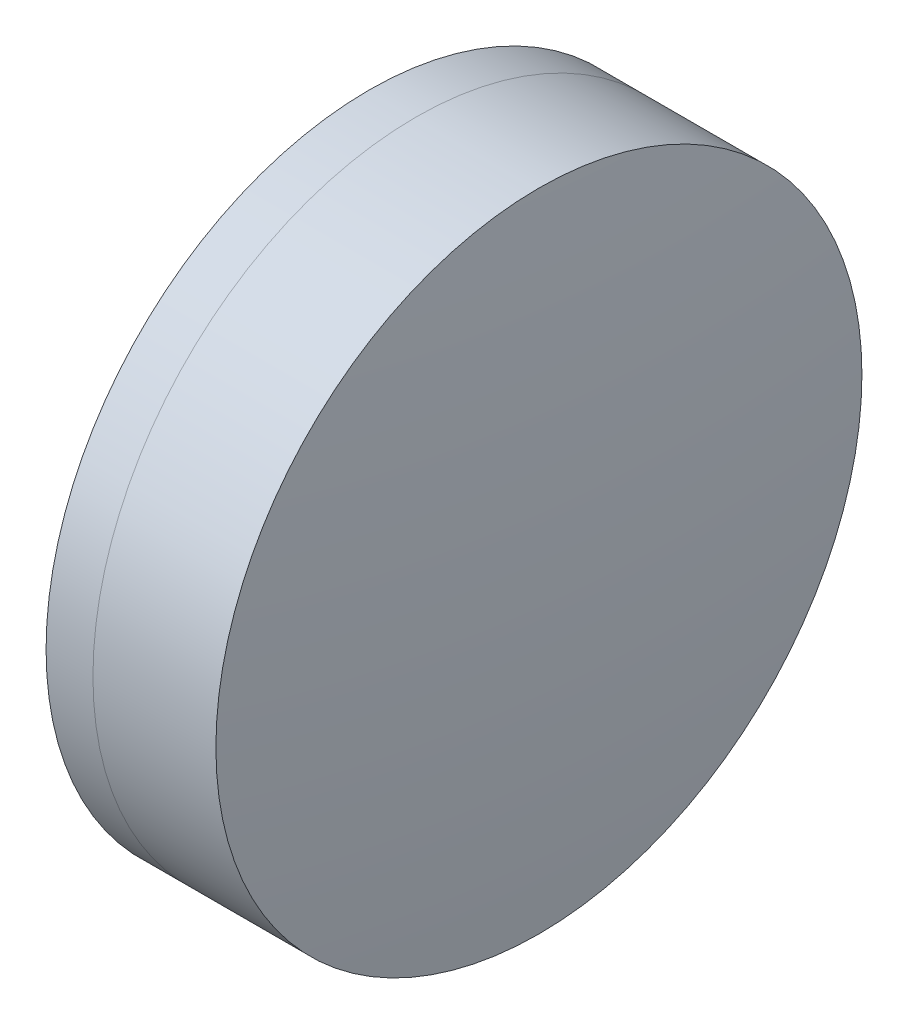
ISO-10303-21;
HEADER;
FILE_DESCRIPTION(('STEP AP214'),'2;1');
FILE_NAME('part.step','',(''),(''),'','','');
FILE_SCHEMA(('AUTOMOTIVE_DESIGN { 1 0 10303 214 1 1 1 1 }'));
ENDSEC;
DATA;
#1=APPLICATION_CONTEXT('core data for automotive mechanical design processes');
#2=APPLICATION_PROTOCOL_DEFINITION('international standard','automotive_design',2000,#1);
#3=PRODUCT_CONTEXT('',#1,'mechanical');
#4=PRODUCT('Part','Part','',(#3));
#5=PRODUCT_RELATED_PRODUCT_CATEGORY('part','',(#4));
#6=PRODUCT_DEFINITION_FORMATION('','',#4);
#7=PRODUCT_DEFINITION_CONTEXT('part definition',#1,'design');
#8=PRODUCT_DEFINITION('design','',#6,#7);
#9=PRODUCT_DEFINITION_SHAPE('','',#8);
#10=(LENGTH_UNIT() NAMED_UNIT(*) SI_UNIT(.MILLI.,.METRE.));
#11=(NAMED_UNIT(*) PLANE_ANGLE_UNIT() SI_UNIT($,.RADIAN.));
#12=(NAMED_UNIT(*) SI_UNIT($,.STERADIAN.) SOLID_ANGLE_UNIT());
#13=UNCERTAINTY_MEASURE_WITH_UNIT(LENGTH_MEASURE(1.E-05),#10,'distance_accuracy_value','');
#14=(GEOMETRIC_REPRESENTATION_CONTEXT(3) GLOBAL_UNCERTAINTY_ASSIGNED_CONTEXT((#13)) GLOBAL_UNIT_ASSIGNED_CONTEXT((#10,
#11,#12)) REPRESENTATION_CONTEXT('',''));
#15=CARTESIAN_POINT('',(0.,0.,0.));
#16=DIRECTION('',(0.,0.,1.));
#17=DIRECTION('',(1.,0.,0.));
#18=AXIS2_PLACEMENT_3D('',#15,#16,#17);
#19=CARTESIAN_POINT('',(230.08415320133,0.,0.));
#20=DIRECTION('',(-1.,0.,0.));
#21=DIRECTION('',(0.,0.,1.));
#22=AXIS2_PLACEMENT_3D('',#19,#20,#21);
#23=SPHERICAL_SURFACE('',#22,35.56);
#24=CARTESIAN_POINT('',(259.486765330187,0.,0.));
#25=DIRECTION('',(-1.,0.,0.));
#26=DIRECTION('',(0.,0.,1.));
#27=AXIS2_PLACEMENT_3D('',#24,#25,#26);
#28=CIRCLE('',#27,20.);
#29=CARTESIAN_POINT('',(259.486765330187,0.,20.));
#30=VERTEX_POINT('',#29);
#31=EDGE_CURVE('E11',#30,#30,#28,.T.);
#32=ORIENTED_EDGE('',*,*,#31,.T.);
#33=EDGE_LOOP('',(#32));
#34=FACE_BOUND('',#33,.T.);
#35=ADVANCED_FACE('F45',(#34),#23,.F.);
#36=CARTESIAN_POINT('',(-0.551919992657797,0.,0.));
#37=DIRECTION('',(-1.,0.,0.));
#38=DIRECTION('',(0.,0.,1.));
#39=AXIS2_PLACEMENT_3D('',#36,#37,#38);
#40=CYLINDRICAL_SURFACE('',#39,20.);
#41=CARTESIAN_POINT('',(267.098933824812,0.,0.));
#42=DIRECTION('',(-1.,0.,0.));
#43=DIRECTION('',(0.,0.,1.));
#44=AXIS2_PLACEMENT_3D('',#41,#42,#43);
#45=CIRCLE('',#44,20.);
#46=CARTESIAN_POINT('',(267.098933824812,0.,20.));
#47=VERTEX_POINT('',#46);
#48=EDGE_CURVE('E51',#47,#47,#45,.T.);
#49=ORIENTED_EDGE('',*,*,#48,.T.);
#50=EDGE_LOOP('',(#49));
#51=FACE_BOUND('',#50,.T.);
#52=ORIENTED_EDGE('',*,*,#31,.F.);
#53=EDGE_LOOP('',(#52));
#54=FACE_BOUND('',#53,.T.);
#55=ADVANCED_FACE('F57',(#51,#54),#40,.T.);
#56=CARTESIAN_POINT('',(76.2741532013301,0.,0.));
#57=DIRECTION('',(-1.,0.,0.));
#58=DIRECTION('',(0.,0.,1.));
#59=AXIS2_PLACEMENT_3D('',#56,#57,#58);
#60=SPHERICAL_SURFACE('',#59,191.87);
#61=ORIENTED_EDGE('',*,*,#48,.F.);
#62=EDGE_LOOP('',(#61));
#63=FACE_BOUND('',#62,.T.);
#64=ADVANCED_FACE('F60',(#63),#60,.T.);
#65=CLOSED_SHELL('',(#35,#55,#64));
#66=MANIFOLD_SOLID_BREP('B2',#65);
#67=CARTESIAN_POINT('',(294.59415320133,0.,0.));
#68=DIRECTION('',(-1.,0.,0.));
#69=DIRECTION('',(0.,0.,-1.));
#70=AXIS2_PLACEMENT_3D('',#67,#68,#69);
#71=SPHERICAL_SURFACE('',#70,42.95);
#72=CARTESIAN_POINT('',(256.584910904226,0.,0.));
#73=DIRECTION('',(-1.,0.,0.));
#74=DIRECTION('',(0.,0.,1.));
#75=AXIS2_PLACEMENT_3D('',#72,#73,#74);
#76=CIRCLE('',#75,20.);
#77=CARTESIAN_POINT('',(256.584910904226,0.,20.));
#78=VERTEX_POINT('',#77);
#79=EDGE_CURVE('E44',#78,#78,#76,.T.);
#80=ORIENTED_EDGE('',*,*,#79,.T.);
#81=EDGE_LOOP('',(#80));
#82=FACE_BOUND('',#81,.T.);
#83=ADVANCED_FACE('F86',(#82),#71,.T.);
#84=CARTESIAN_POINT('',(124.523309526045,0.,0.));
#85=DIRECTION('',(-1.,0.,0.));
#86=DIRECTION('',(0.,0.,1.));
#87=AXIS2_PLACEMENT_3D('',#84,#85,#86);
#88=CYLINDRICAL_SURFACE('',#87,20.);
#89=CARTESIAN_POINT('',(259.486765330187,0.,0.));
#90=DIRECTION('',(-1.,0.,0.));
#91=DIRECTION('',(0.,0.,1.));
#92=AXIS2_PLACEMENT_3D('',#89,#90,#91);
#93=CIRCLE('',#92,20.);
#94=CARTESIAN_POINT('',(259.486765330187,0.,20.));
#95=VERTEX_POINT('',#94);
#96=EDGE_CURVE('E92',#95,#95,#93,.T.);
#97=ORIENTED_EDGE('',*,*,#96,.T.);
#98=EDGE_LOOP('',(#97));
#99=FACE_BOUND('',#98,.T.);
#100=ORIENTED_EDGE('',*,*,#79,.F.);
#101=EDGE_LOOP('',(#100));
#102=FACE_BOUND('',#101,.T.);
#103=ADVANCED_FACE('F98',(#99,#102),#88,.T.);
#104=CARTESIAN_POINT('',(230.08415320133,0.,0.));
#105=DIRECTION('',(-1.,0.,0.));
#106=DIRECTION('',(0.,0.,1.));
#107=AXIS2_PLACEMENT_3D('',#104,#105,#106);
#108=SPHERICAL_SURFACE('',#107,35.56);
#109=ORIENTED_EDGE('',*,*,#96,.F.);
#110=EDGE_LOOP('',(#109));
#111=FACE_BOUND('',#110,.T.);
#112=ADVANCED_FACE('F101',(#111),#108,.T.);
#113=CLOSED_SHELL('',(#83,#103,#112));
#114=MANIFOLD_SOLID_BREP('B6',#113);
#115=ADVANCED_BREP_SHAPE_REPRESENTATION('',(#18,#66,#114),#14);
#116=SHAPE_DEFINITION_REPRESENTATION(#9,#115);
ENDSEC;
END-ISO-10303-21;
